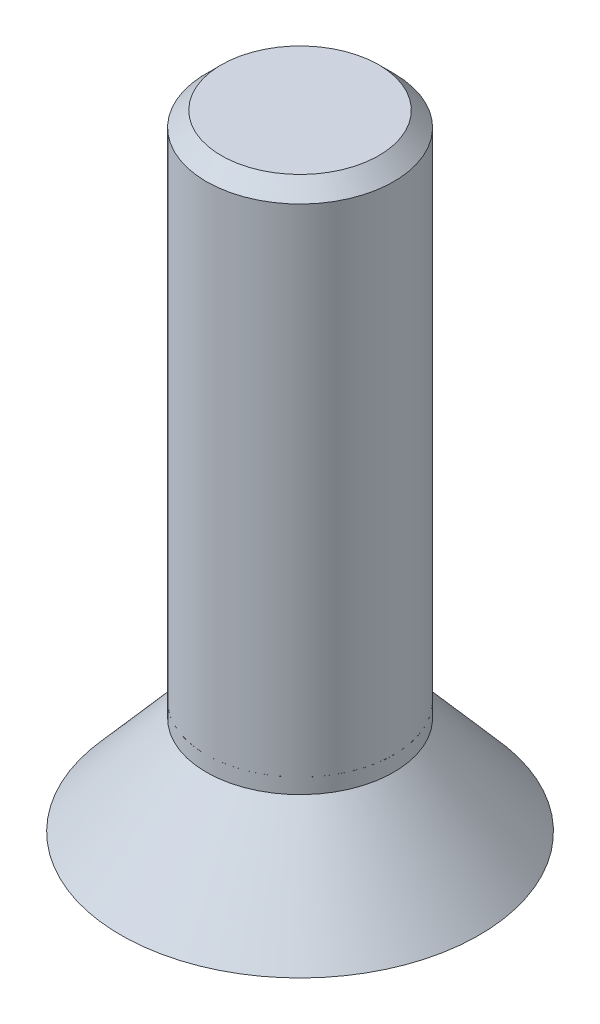
ISO-10303-21;
HEADER;
FILE_DESCRIPTION(('STEP AP214'),'2;1');
FILE_NAME('part.step','',(''),(''),'','','');
FILE_SCHEMA(('AUTOMOTIVE_DESIGN { 1 0 10303 214 1 1 1 1 }'));
ENDSEC;
DATA;
#1=APPLICATION_CONTEXT('core data for automotive mechanical design processes');
#2=APPLICATION_PROTOCOL_DEFINITION('international standard','automotive_design',2000,#1);
#3=PRODUCT_CONTEXT('',#1,'mechanical');
#4=PRODUCT('Part','Part','',(#3));
#5=PRODUCT_RELATED_PRODUCT_CATEGORY('part','',(#4));
#6=PRODUCT_DEFINITION_FORMATION('','',#4);
#7=PRODUCT_DEFINITION_CONTEXT('part definition',#1,'design');
#8=PRODUCT_DEFINITION('design','',#6,#7);
#9=PRODUCT_DEFINITION_SHAPE('','',#8);
#10=(LENGTH_UNIT() NAMED_UNIT(*) SI_UNIT(.MILLI.,.METRE.));
#11=(NAMED_UNIT(*) PLANE_ANGLE_UNIT() SI_UNIT($,.RADIAN.));
#12=(NAMED_UNIT(*) SI_UNIT($,.STERADIAN.) SOLID_ANGLE_UNIT());
#13=UNCERTAINTY_MEASURE_WITH_UNIT(LENGTH_MEASURE(1.E-05),#10,'distance_accuracy_value','');
#14=(GEOMETRIC_REPRESENTATION_CONTEXT(3) GLOBAL_UNCERTAINTY_ASSIGNED_CONTEXT((#13)) GLOBAL_UNIT_ASSIGNED_CONTEXT((#10,
#11,#12)) REPRESENTATION_CONTEXT('',''));
#15=CARTESIAN_POINT('',(0.,0.,0.));
#16=DIRECTION('',(0.,0.,1.));
#17=DIRECTION('',(1.,0.,0.));
#18=AXIS2_PLACEMENT_3D('',#15,#16,#17);
#19=CARTESIAN_POINT('',(0.,3.175,0.));
#20=DIRECTION('',(0.,-1.,0.));
#21=DIRECTION('',(0.,0.,-1.));
#22=AXIS2_PLACEMENT_3D('',#19,#20,#21);
#23=PLANE('',#22);
#24=DIRECTION('',(0.,0.,1.));
#25=VECTOR('',#24,1.);
#26=CARTESIAN_POINT('',(-1.016,3.175,4.7625));
#27=LINE('',#26,#25);
#28=CARTESIAN_POINT('',(-1.016,3.175,4.7625));
#29=VERTEX_POINT('',#28);
#30=CARTESIAN_POINT('',(-1.016,3.175,1.016));
#31=VERTEX_POINT('',#30);
#32=EDGE_CURVE('P0_E110',#29,#31,#27,.F.);
#33=ORIENTED_EDGE('',*,*,#32,.T.);
#34=DIRECTION('',(1.,0.,0.));
#35=VECTOR('',#34,1.);
#36=CARTESIAN_POINT('',(-1.016,3.175,1.016));
#37=LINE('',#36,#35);
#38=CARTESIAN_POINT('',(-4.7625,3.175,1.016));
#39=VERTEX_POINT('',#38);
#40=EDGE_CURVE('P0_E107',#31,#39,#37,.F.);
#41=ORIENTED_EDGE('',*,*,#40,.T.);
#42=DIRECTION('',(0.,0.,1.));
#43=VECTOR('',#42,1.);
#44=CARTESIAN_POINT('',(-4.7625,3.175,1.016));
#45=LINE('',#44,#43);
#46=CARTESIAN_POINT('',(-4.7625,3.175,-1.016));
#47=VERTEX_POINT('',#46);
#48=EDGE_CURVE('P0_E104',#39,#47,#45,.F.);
#49=ORIENTED_EDGE('',*,*,#48,.T.);
#50=DIRECTION('',(-1.,0.,0.));
#51=VECTOR('',#50,1.);
#52=CARTESIAN_POINT('',(-4.7625,3.175,-1.016));
#53=LINE('',#52,#51);
#54=CARTESIAN_POINT('',(-1.016,3.175,-1.016));
#55=VERTEX_POINT('',#54);
#56=EDGE_CURVE('P0_E127',#47,#55,#53,.F.);
#57=ORIENTED_EDGE('',*,*,#56,.T.);
#58=DIRECTION('',(0.,0.,1.));
#59=VECTOR('',#58,1.);
#60=CARTESIAN_POINT('',(-1.016,3.175,-1.016));
#61=LINE('',#60,#59);
#62=CARTESIAN_POINT('',(-1.016,3.175,-4.7625));
#63=VERTEX_POINT('',#62);
#64=EDGE_CURVE('P0_E205',#55,#63,#61,.F.);
#65=ORIENTED_EDGE('',*,*,#64,.T.);
#66=DIRECTION('',(-1.,0.,0.));
#67=VECTOR('',#66,1.);
#68=CARTESIAN_POINT('',(-1.016,3.175,-4.7625));
#69=LINE('',#68,#67);
#70=CARTESIAN_POINT('',(1.016,3.175,-4.7625));
#71=VERTEX_POINT('',#70);
#72=EDGE_CURVE('P0_E200',#63,#71,#69,.F.);
#73=ORIENTED_EDGE('',*,*,#72,.T.);
#74=DIRECTION('',(0.,0.,-1.));
#75=VECTOR('',#74,1.);
#76=CARTESIAN_POINT('',(1.016,3.175,-4.7625));
#77=LINE('',#76,#75);
#78=CARTESIAN_POINT('',(1.016,3.175,-1.016));
#79=VERTEX_POINT('',#78);
#80=EDGE_CURVE('P0_E195',#71,#79,#77,.F.);
#81=ORIENTED_EDGE('',*,*,#80,.T.);
#82=DIRECTION('',(-1.,0.,0.));
#83=VECTOR('',#82,1.);
#84=CARTESIAN_POINT('',(1.016,3.175,-1.016));
#85=LINE('',#84,#83);
#86=CARTESIAN_POINT('',(4.7625,3.175,-1.016));
#87=VERTEX_POINT('',#86);
#88=EDGE_CURVE('P0_E190',#79,#87,#85,.F.);
#89=ORIENTED_EDGE('',*,*,#88,.T.);
#90=DIRECTION('',(0.,0.,-1.));
#91=VECTOR('',#90,1.);
#92=CARTESIAN_POINT('',(4.7625,3.175,-1.016));
#93=LINE('',#92,#91);
#94=CARTESIAN_POINT('',(4.7625,3.175,1.016));
#95=VERTEX_POINT('',#94);
#96=EDGE_CURVE('P0_E185',#87,#95,#93,.F.);
#97=ORIENTED_EDGE('',*,*,#96,.T.);
#98=DIRECTION('',(1.,0.,0.));
#99=VECTOR('',#98,1.);
#100=CARTESIAN_POINT('',(4.7625,3.175,1.016));
#101=LINE('',#100,#99);
#102=CARTESIAN_POINT('',(1.016,3.175,1.016));
#103=VERTEX_POINT('',#102);
#104=EDGE_CURVE('P0_E180',#95,#103,#101,.F.);
#105=ORIENTED_EDGE('',*,*,#104,.T.);
#106=DIRECTION('',(0.,0.,-1.));
#107=VECTOR('',#106,1.);
#108=CARTESIAN_POINT('',(1.016,3.175,1.016));
#109=LINE('',#108,#107);
#110=CARTESIAN_POINT('',(1.016,3.175,4.7625));
#111=VERTEX_POINT('',#110);
#112=EDGE_CURVE('P0_E175',#103,#111,#109,.F.);
#113=ORIENTED_EDGE('',*,*,#112,.T.);
#114=DIRECTION('',(1.,0.,0.));
#115=VECTOR('',#114,1.);
#116=CARTESIAN_POINT('',(1.016,3.175,4.7625));
#117=LINE('',#116,#115);
#118=EDGE_CURVE('P0_E170',#111,#29,#117,.F.);
#119=ORIENTED_EDGE('',*,*,#118,.T.);
#120=EDGE_LOOP('',(#33,#41,#49,#57,#65,#73,#81,#89,#97,#105,#113,#119));
#121=FACE_BOUND('',#120,.T.);
#122=ADVANCED_FACE('P0_F17',(#121),#23,.T.);
#123=CARTESIAN_POINT('',(-1.016,0.,1.016));
#124=DIRECTION('',(0.,0.,1.));
#125=DIRECTION('',(1.,0.,0.));
#126=AXIS2_PLACEMENT_3D('',#123,#124,#125);
#127=PLANE('',#126);
#128=ORIENTED_EDGE('',*,*,#40,.F.);
#129=DIRECTION('',(0.,1.,0.));
#130=VECTOR('',#129,1.);
#131=CARTESIAN_POINT('',(-1.016,0.,1.016));
#132=LINE('',#131,#130);
#133=CARTESIAN_POINT('',(-1.016,0.,1.016));
#134=VERTEX_POINT('',#133);
#135=EDGE_CURVE('P0_E164',#31,#134,#132,.F.);
#136=ORIENTED_EDGE('',*,*,#135,.T.);
#137=DIRECTION('',(1.,0.,0.));
#138=VECTOR('',#137,1.);
#139=CARTESIAN_POINT('',(0.,0.,1.016));
#140=LINE('',#139,#138);
#141=CARTESIAN_POINT('',(-4.7625,0.,1.016));
#142=VERTEX_POINT('',#141);
#143=EDGE_CURVE('P0_E118',#134,#142,#140,.F.);
#144=ORIENTED_EDGE('',*,*,#143,.T.);
#145=DIRECTION('',(0.,1.,0.));
#146=VECTOR('',#145,1.);
#147=CARTESIAN_POINT('',(-4.7625,0.,1.016));
#148=LINE('',#147,#146);
#149=EDGE_CURVE('P0_E113',#142,#39,#148,.T.);
#150=ORIENTED_EDGE('',*,*,#149,.T.);
#151=EDGE_LOOP('',(#128,#136,#144,#150));
#152=FACE_BOUND('',#151,.T.);
#153=ADVANCED_FACE('P0_F116',(#152),#127,.F.);
#154=CARTESIAN_POINT('',(-4.7625,0.,1.016));
#155=DIRECTION('',(-1.,0.,0.));
#156=DIRECTION('',(0.,0.,1.));
#157=AXIS2_PLACEMENT_3D('',#154,#155,#156);
#158=PLANE('',#157);
#159=ORIENTED_EDGE('',*,*,#48,.F.);
#160=ORIENTED_EDGE('',*,*,#149,.F.);
#161=DIRECTION('',(0.,0.,1.));
#162=VECTOR('',#161,1.);
#163=CARTESIAN_POINT('',(-4.7625,0.,0.));
#164=LINE('',#163,#162);
#165=CARTESIAN_POINT('',(-4.7625,0.,-1.016));
#166=VERTEX_POINT('',#165);
#167=EDGE_CURVE('P0_E162',#142,#166,#164,.F.);
#168=ORIENTED_EDGE('',*,*,#167,.T.);
#169=DIRECTION('',(0.,1.,0.));
#170=VECTOR('',#169,1.);
#171=CARTESIAN_POINT('',(-4.7625,0.,-1.016));
#172=LINE('',#171,#170);
#173=EDGE_CURVE('P0_E124',#166,#47,#172,.T.);
#174=ORIENTED_EDGE('',*,*,#173,.T.);
#175=EDGE_LOOP('',(#159,#160,#168,#174));
#176=FACE_BOUND('',#175,.T.);
#177=ADVANCED_FACE('P0_F122',(#176),#158,.F.);
#178=CARTESIAN_POINT('',(-4.7625,0.,-1.016));
#179=DIRECTION('',(0.,0.,-1.));
#180=DIRECTION('',(-1.,0.,0.));
#181=AXIS2_PLACEMENT_3D('',#178,#179,#180);
#182=PLANE('',#181);
#183=ORIENTED_EDGE('',*,*,#56,.F.);
#184=ORIENTED_EDGE('',*,*,#173,.F.);
#185=DIRECTION('',(1.,0.,0.));
#186=VECTOR('',#185,1.);
#187=CARTESIAN_POINT('',(0.,0.,-1.016));
#188=LINE('',#187,#186);
#189=CARTESIAN_POINT('',(-1.016,0.,-1.016));
#190=VERTEX_POINT('',#189);
#191=EDGE_CURVE('P0_E160',#166,#190,#188,.T.);
#192=ORIENTED_EDGE('',*,*,#191,.T.);
#193=DIRECTION('',(0.,1.,0.));
#194=VECTOR('',#193,1.);
#195=CARTESIAN_POINT('',(-1.016,0.,-1.016));
#196=LINE('',#195,#194);
#197=EDGE_CURVE('P0_E207',#190,#55,#196,.T.);
#198=ORIENTED_EDGE('',*,*,#197,.T.);
#199=EDGE_LOOP('',(#183,#184,#192,#198));
#200=FACE_BOUND('',#199,.T.);
#201=ADVANCED_FACE('P0_F212',(#200),#182,.F.);
#202=CARTESIAN_POINT('',(-1.016,0.,-1.016));
#203=DIRECTION('',(-1.,0.,0.));
#204=DIRECTION('',(0.,0.,1.));
#205=AXIS2_PLACEMENT_3D('',#202,#203,#204);
#206=PLANE('',#205);
#207=ORIENTED_EDGE('',*,*,#64,.F.);
#208=ORIENTED_EDGE('',*,*,#197,.F.);
#209=DIRECTION('',(0.,0.,1.));
#210=VECTOR('',#209,1.);
#211=CARTESIAN_POINT('',(-1.016,0.,0.));
#212=LINE('',#211,#210);
#213=CARTESIAN_POINT('',(-1.016,0.,-4.7625));
#214=VERTEX_POINT('',#213);
#215=EDGE_CURVE('P0_E158',#190,#214,#212,.F.);
#216=ORIENTED_EDGE('',*,*,#215,.T.);
#217=DIRECTION('',(0.,1.,0.));
#218=VECTOR('',#217,1.);
#219=CARTESIAN_POINT('',(-1.016,0.,-4.7625));
#220=LINE('',#219,#218);
#221=EDGE_CURVE('P0_E202',#214,#63,#220,.T.);
#222=ORIENTED_EDGE('',*,*,#221,.T.);
#223=EDGE_LOOP('',(#207,#208,#216,#222));
#224=FACE_BOUND('',#223,.T.);
#225=ADVANCED_FACE('P0_F216',(#224),#206,.F.);
#226=CARTESIAN_POINT('',(-1.016,0.,-4.7625));
#227=DIRECTION('',(0.,0.,-1.));
#228=DIRECTION('',(-1.,0.,0.));
#229=AXIS2_PLACEMENT_3D('',#226,#227,#228);
#230=PLANE('',#229);
#231=ORIENTED_EDGE('',*,*,#72,.F.);
#232=ORIENTED_EDGE('',*,*,#221,.F.);
#233=DIRECTION('',(1.,0.,0.));
#234=VECTOR('',#233,1.);
#235=CARTESIAN_POINT('',(0.,0.,-4.7625));
#236=LINE('',#235,#234);
#237=CARTESIAN_POINT('',(1.016,0.,-4.7625));
#238=VERTEX_POINT('',#237);
#239=EDGE_CURVE('P0_E156',#214,#238,#236,.T.);
#240=ORIENTED_EDGE('',*,*,#239,.T.);
#241=DIRECTION('',(0.,1.,0.));
#242=VECTOR('',#241,1.);
#243=CARTESIAN_POINT('',(1.016,0.,-4.7625));
#244=LINE('',#243,#242);
#245=EDGE_CURVE('P0_E197',#238,#71,#244,.T.);
#246=ORIENTED_EDGE('',*,*,#245,.T.);
#247=EDGE_LOOP('',(#231,#232,#240,#246));
#248=FACE_BOUND('',#247,.T.);
#249=ADVANCED_FACE('P0_F221',(#248),#230,.F.);
#250=CARTESIAN_POINT('',(1.016,0.,-4.7625));
#251=DIRECTION('',(1.,0.,0.));
#252=DIRECTION('',(0.,0.,-1.));
#253=AXIS2_PLACEMENT_3D('',#250,#251,#252);
#254=PLANE('',#253);
#255=ORIENTED_EDGE('',*,*,#80,.F.);
#256=ORIENTED_EDGE('',*,*,#245,.F.);
#257=DIRECTION('',(0.,0.,1.));
#258=VECTOR('',#257,1.);
#259=CARTESIAN_POINT('',(1.016,0.,0.));
#260=LINE('',#259,#258);
#261=CARTESIAN_POINT('',(1.016,0.,-1.016));
#262=VERTEX_POINT('',#261);
#263=EDGE_CURVE('P0_E154',#238,#262,#260,.T.);
#264=ORIENTED_EDGE('',*,*,#263,.T.);
#265=DIRECTION('',(0.,1.,0.));
#266=VECTOR('',#265,1.);
#267=CARTESIAN_POINT('',(1.016,0.,-1.016));
#268=LINE('',#267,#266);
#269=EDGE_CURVE('P0_E192',#262,#79,#268,.T.);
#270=ORIENTED_EDGE('',*,*,#269,.T.);
#271=EDGE_LOOP('',(#255,#256,#264,#270));
#272=FACE_BOUND('',#271,.T.);
#273=ADVANCED_FACE('P0_F227',(#272),#254,.F.);
#274=CARTESIAN_POINT('',(1.016,0.,-1.016));
#275=DIRECTION('',(0.,0.,-1.));
#276=DIRECTION('',(-1.,0.,0.));
#277=AXIS2_PLACEMENT_3D('',#274,#275,#276);
#278=PLANE('',#277);
#279=ORIENTED_EDGE('',*,*,#88,.F.);
#280=ORIENTED_EDGE('',*,*,#269,.F.);
#281=DIRECTION('',(1.,0.,0.));
#282=VECTOR('',#281,1.);
#283=CARTESIAN_POINT('',(0.,0.,-1.016));
#284=LINE('',#283,#282);
#285=CARTESIAN_POINT('',(4.7625,0.,-1.016));
#286=VERTEX_POINT('',#285);
#287=EDGE_CURVE('P0_E152',#262,#286,#284,.T.);
#288=ORIENTED_EDGE('',*,*,#287,.T.);
#289=DIRECTION('',(0.,1.,0.));
#290=VECTOR('',#289,1.);
#291=CARTESIAN_POINT('',(4.7625,0.,-1.016));
#292=LINE('',#291,#290);
#293=EDGE_CURVE('P0_E187',#286,#87,#292,.T.);
#294=ORIENTED_EDGE('',*,*,#293,.T.);
#295=EDGE_LOOP('',(#279,#280,#288,#294));
#296=FACE_BOUND('',#295,.T.);
#297=ADVANCED_FACE('P0_F231',(#296),#278,.F.);
#298=CARTESIAN_POINT('',(4.7625,0.,-1.016));
#299=DIRECTION('',(1.,0.,0.));
#300=DIRECTION('',(0.,0.,-1.));
#301=AXIS2_PLACEMENT_3D('',#298,#299,#300);
#302=PLANE('',#301);
#303=ORIENTED_EDGE('',*,*,#96,.F.);
#304=ORIENTED_EDGE('',*,*,#293,.F.);
#305=DIRECTION('',(0.,0.,1.));
#306=VECTOR('',#305,1.);
#307=CARTESIAN_POINT('',(4.7625,0.,0.));
#308=LINE('',#307,#306);
#309=CARTESIAN_POINT('',(4.7625,0.,1.016));
#310=VERTEX_POINT('',#309);
#311=EDGE_CURVE('P0_E150',#286,#310,#308,.T.);
#312=ORIENTED_EDGE('',*,*,#311,.T.);
#313=DIRECTION('',(0.,1.,0.));
#314=VECTOR('',#313,1.);
#315=CARTESIAN_POINT('',(4.7625,0.,1.016));
#316=LINE('',#315,#314);
#317=EDGE_CURVE('P0_E182',#310,#95,#316,.T.);
#318=ORIENTED_EDGE('',*,*,#317,.T.);
#319=EDGE_LOOP('',(#303,#304,#312,#318));
#320=FACE_BOUND('',#319,.T.);
#321=ADVANCED_FACE('P0_F236',(#320),#302,.F.);
#322=CARTESIAN_POINT('',(4.7625,0.,1.016));
#323=DIRECTION('',(0.,0.,1.));
#324=DIRECTION('',(1.,0.,0.));
#325=AXIS2_PLACEMENT_3D('',#322,#323,#324);
#326=PLANE('',#325);
#327=ORIENTED_EDGE('',*,*,#104,.F.);
#328=ORIENTED_EDGE('',*,*,#317,.F.);
#329=DIRECTION('',(1.,0.,0.));
#330=VECTOR('',#329,1.);
#331=CARTESIAN_POINT('',(0.,0.,1.016));
#332=LINE('',#331,#330);
#333=CARTESIAN_POINT('',(1.016,0.,1.016));
#334=VERTEX_POINT('',#333);
#335=EDGE_CURVE('P0_E148',#310,#334,#332,.F.);
#336=ORIENTED_EDGE('',*,*,#335,.T.);
#337=DIRECTION('',(0.,1.,0.));
#338=VECTOR('',#337,1.);
#339=CARTESIAN_POINT('',(1.016,0.,1.016));
#340=LINE('',#339,#338);
#341=EDGE_CURVE('P0_E177',#334,#103,#340,.T.);
#342=ORIENTED_EDGE('',*,*,#341,.T.);
#343=EDGE_LOOP('',(#327,#328,#336,#342));
#344=FACE_BOUND('',#343,.T.);
#345=ADVANCED_FACE('P0_F242',(#344),#326,.F.);
#346=CARTESIAN_POINT('',(1.016,0.,1.016));
#347=DIRECTION('',(1.,0.,0.));
#348=DIRECTION('',(0.,0.,-1.));
#349=AXIS2_PLACEMENT_3D('',#346,#347,#348);
#350=PLANE('',#349);
#351=ORIENTED_EDGE('',*,*,#112,.F.);
#352=ORIENTED_EDGE('',*,*,#341,.F.);
#353=DIRECTION('',(0.,0.,1.));
#354=VECTOR('',#353,1.);
#355=CARTESIAN_POINT('',(1.016,0.,0.));
#356=LINE('',#355,#354);
#357=CARTESIAN_POINT('',(1.016,0.,4.7625));
#358=VERTEX_POINT('',#357);
#359=EDGE_CURVE('P0_E144',#334,#358,#356,.T.);
#360=ORIENTED_EDGE('',*,*,#359,.T.);
#361=DIRECTION('',(0.,1.,0.));
#362=VECTOR('',#361,1.);
#363=CARTESIAN_POINT('',(1.016,0.,4.7625));
#364=LINE('',#363,#362);
#365=EDGE_CURVE('P0_E172',#358,#111,#364,.T.);
#366=ORIENTED_EDGE('',*,*,#365,.T.);
#367=EDGE_LOOP('',(#351,#352,#360,#366));
#368=FACE_BOUND('',#367,.T.);
#369=ADVANCED_FACE('P0_F246',(#368),#350,.F.);
#370=CARTESIAN_POINT('',(1.016,0.,4.7625));
#371=DIRECTION('',(0.,0.,1.));
#372=DIRECTION('',(1.,0.,0.));
#373=AXIS2_PLACEMENT_3D('',#370,#371,#372);
#374=PLANE('',#373);
#375=ORIENTED_EDGE('',*,*,#118,.F.);
#376=ORIENTED_EDGE('',*,*,#365,.F.);
#377=DIRECTION('',(1.,0.,0.));
#378=VECTOR('',#377,1.);
#379=CARTESIAN_POINT('',(0.,0.,4.7625));
#380=LINE('',#379,#378);
#381=CARTESIAN_POINT('',(-1.016,0.,4.7625));
#382=VERTEX_POINT('',#381);
#383=EDGE_CURVE('P0_E35',#358,#382,#380,.F.);
#384=ORIENTED_EDGE('',*,*,#383,.T.);
#385=DIRECTION('',(0.,1.,0.));
#386=VECTOR('',#385,1.);
#387=CARTESIAN_POINT('',(-1.016,0.,4.7625));
#388=LINE('',#387,#386);
#389=EDGE_CURVE('P0_E168',#382,#29,#388,.T.);
#390=ORIENTED_EDGE('',*,*,#389,.T.);
#391=EDGE_LOOP('',(#375,#376,#384,#390));
#392=FACE_BOUND('',#391,.T.);
#393=ADVANCED_FACE('P0_F248',(#392),#374,.F.);
#394=CARTESIAN_POINT('',(-1.016,0.,4.7625));
#395=DIRECTION('',(-1.,0.,0.));
#396=DIRECTION('',(0.,0.,1.));
#397=AXIS2_PLACEMENT_3D('',#394,#395,#396);
#398=PLANE('',#397);
#399=ORIENTED_EDGE('',*,*,#32,.F.);
#400=ORIENTED_EDGE('',*,*,#389,.F.);
#401=DIRECTION('',(0.,0.,1.));
#402=VECTOR('',#401,1.);
#403=CARTESIAN_POINT('',(-1.016,0.,0.));
#404=LINE('',#403,#402);
#405=EDGE_CURVE('P0_E137',#382,#134,#404,.F.);
#406=ORIENTED_EDGE('',*,*,#405,.T.);
#407=ORIENTED_EDGE('',*,*,#135,.F.);
#408=EDGE_LOOP('',(#399,#400,#406,#407));
#409=FACE_BOUND('',#408,.T.);
#410=ADVANCED_FACE('P0_F249',(#409),#398,.F.);
#411=CARTESIAN_POINT('',(0.,0.,0.));
#412=DIRECTION('',(0.,1.,0.));
#413=DIRECTION('',(0.,0.,1.));
#414=AXIS2_PLACEMENT_3D('',#411,#412,#413);
#415=PLANE('',#414);
#416=ORIENTED_EDGE('',*,*,#383,.F.);
#417=ORIENTED_EDGE('',*,*,#359,.F.);
#418=ORIENTED_EDGE('',*,*,#335,.F.);
#419=ORIENTED_EDGE('',*,*,#311,.F.);
#420=ORIENTED_EDGE('',*,*,#287,.F.);
#421=ORIENTED_EDGE('',*,*,#263,.F.);
#422=ORIENTED_EDGE('',*,*,#239,.F.);
#423=ORIENTED_EDGE('',*,*,#215,.F.);
#424=ORIENTED_EDGE('',*,*,#191,.F.);
#425=ORIENTED_EDGE('',*,*,#167,.F.);
#426=ORIENTED_EDGE('',*,*,#143,.F.);
#427=ORIENTED_EDGE('',*,*,#405,.F.);
#428=EDGE_LOOP('',(#416,#417,#418,#419,#420,#421,#422,#423,#424,#425,#426,#427));
#429=FACE_BOUND('',#428,.T.);
#430=CARTESIAN_POINT('',(0.,0.,0.));
#431=DIRECTION('',(0.,-1.,0.));
#432=DIRECTION('',(0.,0.,-1.));
#433=AXIS2_PLACEMENT_3D('',#430,#431,#432);
#434=CIRCLE('',#433,9.10590000000123);
#435=CARTESIAN_POINT('',(0.,0.,-9.10590000000123));
#436=VERTEX_POINT('',#435);
#437=EDGE_CURVE('P0_E20',#436,#436,#434,.F.);
#438=ORIENTED_EDGE('',*,*,#437,.F.);
#439=EDGE_LOOP('',(#438));
#440=FACE_BOUND('',#439,.T.);
#441=ADVANCED_FACE('P0_F251',(#429,#440),#415,.F.);
#442=CARTESIAN_POINT('',(0.,31.75,0.));
#443=DIRECTION('',(0.,1.,0.));
#444=DIRECTION('',(0.,0.,1.));
#445=AXIS2_PLACEMENT_3D('',#442,#443,#444);
#446=PLANE('',#445);
#447=CARTESIAN_POINT('',(0.,31.7499999999882,0.));
#448=DIRECTION('',(0.,-1.,0.));
#449=DIRECTION('',(0.,0.,-1.));
#450=AXIS2_PLACEMENT_3D('',#447,#448,#449);
#451=CIRCLE('',#450,4.00050000007468);
#452=CARTESIAN_POINT('',(0.,31.7499999999882,-4.00050000007468));
#453=VERTEX_POINT('',#452);
#454=EDGE_CURVE('P0_E130',#453,#453,#451,.T.);
#455=ORIENTED_EDGE('',*,*,#454,.F.);
#456=EDGE_LOOP('',(#455));
#457=FACE_BOUND('',#456,.T.);
#458=ADVANCED_FACE('P0_F258',(#457),#446,.T.);
#459=CARTESIAN_POINT('',(0.,5.6843418860808E-11,0.));
#460=DIRECTION('',(0.,-1.,0.));
#461=DIRECTION('',(0.,0.,-1.));
#462=AXIS2_PLACEMENT_3D('',#459,#460,#461);
#463=CONICAL_SURFACE('',#462,9.10589999995182,0.715584993318439);
#464=CARTESIAN_POINT('',(0.,4.99651013992392,0.));
#465=DIRECTION('',(0.,1.,0.));
#466=DIRECTION('',(0.,0.,1.));
#467=AXIS2_PLACEMENT_3D('',#464,#465,#466);
#468=CIRCLE('',#467,4.7625);
#469=CARTESIAN_POINT('',(0.,4.99651013992392,4.7625));
#470=VERTEX_POINT('',#469);
#471=EDGE_CURVE('P0_E26',#470,#470,#468,.T.);
#472=ORIENTED_EDGE('',*,*,#471,.F.);
#473=EDGE_LOOP('',(#472));
#474=FACE_BOUND('',#473,.T.);
#475=ORIENTED_EDGE('',*,*,#437,.T.);
#476=EDGE_LOOP('',(#475));
#477=FACE_BOUND('',#476,.T.);
#478=ADVANCED_FACE('P0_F270',(#474,#477),#463,.T.);
#479=CARTESIAN_POINT('',(0.,30.9880000000362,0.));
#480=DIRECTION('',(0.,-1.,0.));
#481=DIRECTION('',(0.,0.,-1.));
#482=AXIS2_PLACEMENT_3D('',#479,#480,#481);
#483=CONICAL_SURFACE('',#482,4.76250000002665,0.785398163397448);
#484=CARTESIAN_POINT('',(0.,30.988,0.));
#485=DIRECTION('',(0.,1.,0.));
#486=DIRECTION('',(0.,0.,1.));
#487=AXIS2_PLACEMENT_3D('',#484,#485,#486);
#488=CIRCLE('',#487,4.7625);
#489=CARTESIAN_POINT('',(0.,30.988,4.7625));
#490=VERTEX_POINT('',#489);
#491=EDGE_CURVE('P0_E11',#490,#490,#488,.F.);
#492=ORIENTED_EDGE('',*,*,#491,.F.);
#493=EDGE_LOOP('',(#492));
#494=FACE_BOUND('',#493,.T.);
#495=ORIENTED_EDGE('',*,*,#454,.T.);
#496=EDGE_LOOP('',(#495));
#497=FACE_BOUND('',#496,.T.);
#498=ADVANCED_FACE('P0_F264',(#494,#497),#483,.T.);
#499=CARTESIAN_POINT('',(0.,0.,0.));
#500=DIRECTION('',(0.,1.,0.));
#501=DIRECTION('',(0.,0.,1.));
#502=AXIS2_PLACEMENT_3D('',#499,#500,#501);
#503=CYLINDRICAL_SURFACE('',#502,4.7625);
#504=ORIENTED_EDGE('',*,*,#471,.T.);
#505=EDGE_LOOP('',(#504));
#506=FACE_BOUND('',#505,.T.);
#507=ORIENTED_EDGE('',*,*,#491,.T.);
#508=EDGE_LOOP('',(#507));
#509=FACE_BOUND('',#508,.T.);
#510=ADVANCED_FACE('P0_F262',(#506,#509),#503,.T.);
#511=CLOSED_SHELL('',(#122,#153,#177,#201,#225,#249,#273,#297,#321,#345,#369,#393,#410,#441,
#458,#478,#498,#510));
#512=MANIFOLD_SOLID_BREP('P0_B1',#511);
#513=CARTESIAN_POINT('',(0.,31.75,0.));
#514=DIRECTION('',(0.,1.,0.));
#515=DIRECTION('',(0.,0.,1.));
#516=AXIS2_PLACEMENT_3D('',#513,#514,#515);
#517=CYLINDRICAL_SURFACE('',#516,3.9751);
#518=CARTESIAN_POINT('',(0.,5.7658,0.));
#519=DIRECTION('',(0.,1.,0.));
#520=DIRECTION('',(0.,0.,1.));
#521=AXIS2_PLACEMENT_3D('',#518,#519,#520);
#522=CIRCLE('',#521,3.9751);
#523=CARTESIAN_POINT('',(0.,5.7658,3.9751));
#524=VERTEX_POINT('',#523);
#525=EDGE_CURVE('P1_E21',#524,#524,#522,.T.);
#526=ORIENTED_EDGE('',*,*,#525,.T.);
#527=EDGE_LOOP('',(#526));
#528=FACE_BOUND('',#527,.T.);
#529=CARTESIAN_POINT('',(0.,31.75,0.));
#530=DIRECTION('',(0.,1.,0.));
#531=DIRECTION('',(0.,0.,1.));
#532=AXIS2_PLACEMENT_3D('',#529,#530,#531);
#533=CIRCLE('',#532,3.9751);
#534=CARTESIAN_POINT('',(0.,31.75,3.9751));
#535=VERTEX_POINT('',#534);
#536=EDGE_CURVE('P1_E11',#535,#535,#533,.F.);
#537=ORIENTED_EDGE('',*,*,#536,.T.);
#538=EDGE_LOOP('',(#537));
#539=FACE_BOUND('',#538,.T.);
#540=ADVANCED_FACE('P1_F17',(#528,#539),#517,.T.);
#541=CARTESIAN_POINT('',(0.,5.7658,0.));
#542=DIRECTION('',(0.,1.,0.));
#543=DIRECTION('',(0.,0.,1.));
#544=AXIS2_PLACEMENT_3D('',#541,#542,#543);
#545=PLANE('',#544);
#546=ORIENTED_EDGE('',*,*,#525,.F.);
#547=EDGE_LOOP('',(#546));
#548=FACE_BOUND('',#547,.T.);
#549=CARTESIAN_POINT('',(4.7625,5.7658,0.));
#550=CARTESIAN_POINT('',(4.7625,5.7658,-0.908148625902779));
#551=CARTESIAN_POINT('',(4.42811678380983,5.7658,-1.75305105428842));
#552=CARTESIAN_POINT('',(4.2506356877037,5.7658,-2.20150122113928));
#553=CARTESIAN_POINT('',(3.98619112217883,5.7658,-2.60608645049674));
#554=CARTESIAN_POINT('',(3.71666127734668,5.7658,-3.01845186959188));
#555=CARTESIAN_POINT('',(3.36759604540093,5.7658,-3.36759604540093));
#556=CARTESIAN_POINT('',(3.01928816716202,5.7658,-3.71598269622162));
#557=CARTESIAN_POINT('',(2.60608645049674,5.7658,-3.98619112217883));
#558=CARTESIAN_POINT('',(2.2024382786678,5.7658,-4.25015211931755));
#559=CARTESIAN_POINT('',(1.75305105428842,5.7658,-4.42811678380983));
#560=CARTESIAN_POINT('',(0.908939337675511,5.7658,-4.76239878002917));
#561=CARTESIAN_POINT('',(0.,5.7658,-4.7625));
#562=CARTESIAN_POINT('',(-0.907893162824393,5.7658,-4.76260110346824));
#563=CARTESIAN_POINT('',(-1.75305105428842,5.7658,-4.42811678380983));
#564=CARTESIAN_POINT('',(-2.20150122114081,5.7658,-4.25063568770305));
#565=CARTESIAN_POINT('',(-2.60608645049674,5.7658,-3.98619112217883));
#566=CARTESIAN_POINT('',(-3.0184518695935,5.7658,-3.71666127734526));
#567=CARTESIAN_POINT('',(-3.36759604540093,5.7658,-3.36759604540093));
#568=CARTESIAN_POINT('',(-3.71598269622364,5.7658,-3.0192881671598));
#569=CARTESIAN_POINT('',(-3.98619112217883,5.7658,-2.60608645049674));
#570=CARTESIAN_POINT('',(-4.25015211931801,5.7658,-2.20243827866624));
#571=CARTESIAN_POINT('',(-4.42811678380983,5.7658,-1.75305105428842));
#572=CARTESIAN_POINT('',(-4.7625,5.7658,-0.908683742208062));
#573=CARTESIAN_POINT('',(-4.7625,5.7658,0.));
#574=B_SPLINE_CURVE_WITH_KNOTS('',2,(#549,#550,#551,#552,#553,#554,#555,#556,#557,#558,#559,
#560,#561,#562,#563,#564,#565,#566,#567,#568,#569,#570,#571,#572,#573),.UNSPECIFIED.,.F.,.F.,(3,
2,2,2,2,2,2,2,2,2,2,2,3),(0.,0.125,0.1875,0.25,0.3125,0.375,0.5,0.625,0.6875,0.75,0.8125,0.875,
1.),.UNSPECIFIED.);
#575=CARTESIAN_POINT('',(4.7625,5.7658,0.));
#576=VERTEX_POINT('',#575);
#577=CARTESIAN_POINT('',(-4.7625,5.7658,0.));
#578=VERTEX_POINT('',#577);
#579=EDGE_CURVE('P1_E31',#576,#578,#574,.T.);
#580=ORIENTED_EDGE('',*,*,#579,.T.);
#581=CARTESIAN_POINT('',(-4.7625,5.7658,0.));
#582=CARTESIAN_POINT('',(-4.7625,5.7658,0.908148625902779));
#583=CARTESIAN_POINT('',(-4.42811678380983,5.7658,1.75305105428842));
#584=CARTESIAN_POINT('',(-4.2506356877037,5.7658,2.20150122113928));
#585=CARTESIAN_POINT('',(-3.98619112217883,5.7658,2.60608645049674));
#586=CARTESIAN_POINT('',(-3.71666127734668,5.7658,3.01845186959188));
#587=CARTESIAN_POINT('',(-3.36759604540093,5.7658,3.36759604540093));
#588=CARTESIAN_POINT('',(-3.01928816716202,5.7658,3.71598269622162));
#589=CARTESIAN_POINT('',(-2.60608645049674,5.7658,3.98619112217883));
#590=CARTESIAN_POINT('',(-2.2024382786678,5.7658,4.25015211931755));
#591=CARTESIAN_POINT('',(-1.75305105428842,5.7658,4.42811678380983));
#592=CARTESIAN_POINT('',(-0.908939337675511,5.7658,4.76239878002917));
#593=CARTESIAN_POINT('',(0.,5.7658,4.7625));
#594=CARTESIAN_POINT('',(0.907893162824393,5.7658,4.76260110346824));
#595=CARTESIAN_POINT('',(1.75305105428842,5.7658,4.42811678380983));
#596=CARTESIAN_POINT('',(2.20150122114081,5.7658,4.25063568770305));
#597=CARTESIAN_POINT('',(2.60608645049674,5.7658,3.98619112217883));
#598=CARTESIAN_POINT('',(3.0184518695935,5.7658,3.71666127734526));
#599=CARTESIAN_POINT('',(3.36759604540093,5.7658,3.36759604540093));
#600=CARTESIAN_POINT('',(3.71598269622364,5.7658,3.0192881671598));
#601=CARTESIAN_POINT('',(3.98619112217883,5.7658,2.60608645049674));
#602=CARTESIAN_POINT('',(4.25015211931801,5.7658,2.20243827866624));
#603=CARTESIAN_POINT('',(4.42811678380983,5.7658,1.75305105428842));
#604=CARTESIAN_POINT('',(4.7625,5.7658,0.908683742208062));
#605=CARTESIAN_POINT('',(4.7625,5.7658,0.));
#606=B_SPLINE_CURVE_WITH_KNOTS('',2,(#581,#582,#583,#584,#585,#586,#587,#588,#589,#590,#591,
#592,#593,#594,#595,#596,#597,#598,#599,#600,#601,#602,#603,#604,#605),.UNSPECIFIED.,.F.,.F.,(3,
2,2,2,2,2,2,2,2,2,2,2,3),(0.,0.125,0.1875,0.25,0.3125,0.375,0.5,0.625,0.6875,0.75,0.8125,0.875,
1.),.UNSPECIFIED.);
#607=EDGE_CURVE('P1_E34',#578,#576,#606,.T.);
#608=ORIENTED_EDGE('',*,*,#607,.T.);
#609=EDGE_LOOP('',(#580,#608));
#610=FACE_BOUND('',#609,.T.);
#611=ADVANCED_FACE('P1_F18',(#548,#610),#545,.T.);
#612=OPEN_SHELL('',(#540,#611));
#613=SHELL_BASED_SURFACE_MODEL('P1_B1',(#612));
#614=ADVANCED_BREP_SHAPE_REPRESENTATION('',(#18,#512),#14);
#615=MANIFOLD_SURFACE_SHAPE_REPRESENTATION('',(#18,#613),#14);
#616=SHAPE_REPRESENTATION('',(#18),#14);
#617=SHAPE_DEFINITION_REPRESENTATION(#9,#616);
#618=SHAPE_REPRESENTATION_RELATIONSHIP('','',#616,#614);
#619=SHAPE_REPRESENTATION_RELATIONSHIP('','',#616,#615);
ENDSEC;
END-ISO-10303-21;
